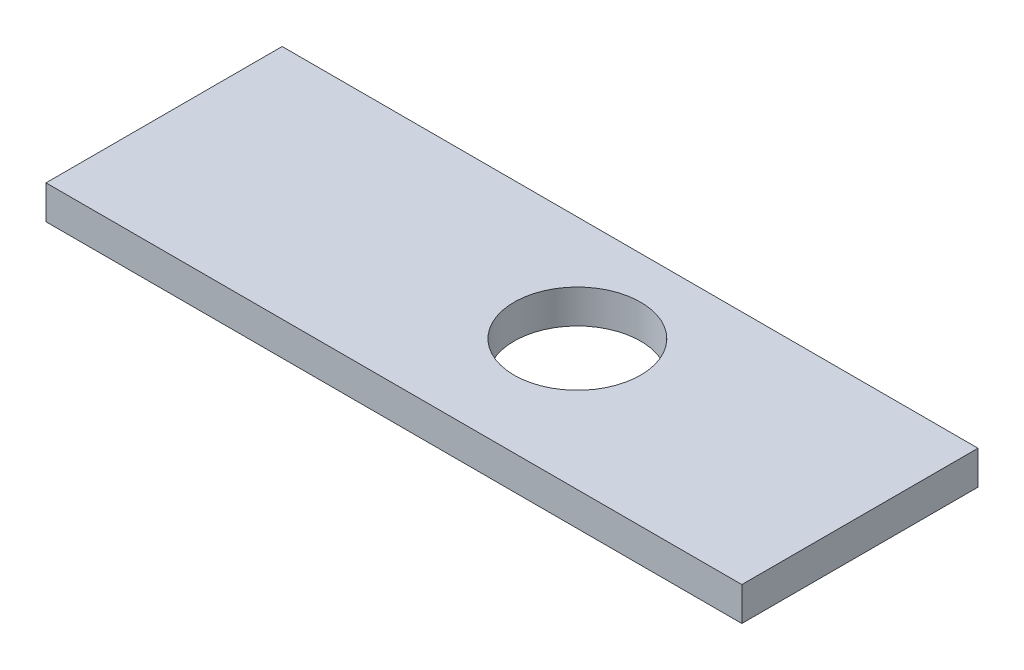
ISO-10303-21;
HEADER;
FILE_DESCRIPTION(('STEP AP214'),'2;1');
FILE_NAME('part.step','',(''),(''),'','','');
FILE_SCHEMA(('AUTOMOTIVE_DESIGN { 1 0 10303 214 1 1 1 1 }'));
ENDSEC;
DATA;
#1=APPLICATION_CONTEXT('core data for automotive mechanical design processes');
#2=APPLICATION_PROTOCOL_DEFINITION('international standard','automotive_design',2000,#1);
#3=PRODUCT_CONTEXT('',#1,'mechanical');
#4=PRODUCT('Part','Part','',(#3));
#5=PRODUCT_RELATED_PRODUCT_CATEGORY('part','',(#4));
#6=PRODUCT_DEFINITION_FORMATION('','',#4);
#7=PRODUCT_DEFINITION_CONTEXT('part definition',#1,'design');
#8=PRODUCT_DEFINITION('design','',#6,#7);
#9=PRODUCT_DEFINITION_SHAPE('','',#8);
#10=(LENGTH_UNIT() NAMED_UNIT(*) SI_UNIT(.MILLI.,.METRE.));
#11=(NAMED_UNIT(*) PLANE_ANGLE_UNIT() SI_UNIT($,.RADIAN.));
#12=(NAMED_UNIT(*) SI_UNIT($,.STERADIAN.) SOLID_ANGLE_UNIT());
#13=UNCERTAINTY_MEASURE_WITH_UNIT(LENGTH_MEASURE(1.E-05),#10,'distance_accuracy_value','');
#14=(GEOMETRIC_REPRESENTATION_CONTEXT(3) GLOBAL_UNCERTAINTY_ASSIGNED_CONTEXT((#13)) GLOBAL_UNIT_ASSIGNED_CONTEXT((#10,
#11,#12)) REPRESENTATION_CONTEXT('',''));
#15=CARTESIAN_POINT('',(0.,0.,0.));
#16=DIRECTION('',(0.,0.,1.));
#17=DIRECTION('',(1.,0.,0.));
#18=AXIS2_PLACEMENT_3D('',#15,#16,#17);
#19=CARTESIAN_POINT('',(0.,8.,0.));
#20=DIRECTION('',(0.,1.,0.));
#21=DIRECTION('',(0.,0.,1.));
#22=AXIS2_PLACEMENT_3D('',#19,#20,#21);
#23=PLANE('',#22);
#24=CARTESIAN_POINT('',(12.5,7.99999999999994,-3.));
#25=DIRECTION('',(0.,1.,0.));
#26=DIRECTION('',(0.,0.,1.));
#27=AXIS2_PLACEMENT_3D('',#24,#25,#26);
#28=CIRCLE('',#27,15.);
#29=CARTESIAN_POINT('',(12.5,7.99999999999994,12.));
#30=VERTEX_POINT('',#29);
#31=EDGE_CURVE('E19',#30,#30,#28,.F.);
#32=ORIENTED_EDGE('',*,*,#31,.T.);
#33=EDGE_LOOP('',(#32));
#34=FACE_BOUND('',#33,.T.);
#35=DIRECTION('',(-1.,0.,0.));
#36=VECTOR('',#35,1.);
#37=CARTESIAN_POINT('',(82.5,8.,-28.));
#38=LINE('',#37,#36);
#39=CARTESIAN_POINT('',(-82.5,8.,-28.));
#40=VERTEX_POINT('',#39);
#41=CARTESIAN_POINT('',(82.5,8.,-28.));
#42=VERTEX_POINT('',#41);
#43=EDGE_CURVE('E69',#40,#42,#38,.F.);
#44=ORIENTED_EDGE('',*,*,#43,.F.);
#45=DIRECTION('',(0.,0.,1.));
#46=VECTOR('',#45,1.);
#47=CARTESIAN_POINT('',(-82.5,8.,-28.));
#48=LINE('',#47,#46);
#49=CARTESIAN_POINT('',(-82.5,8.,28.));
#50=VERTEX_POINT('',#49);
#51=EDGE_CURVE('E66',#50,#40,#48,.F.);
#52=ORIENTED_EDGE('',*,*,#51,.F.);
#53=DIRECTION('',(1.,0.,0.));
#54=VECTOR('',#53,1.);
#55=CARTESIAN_POINT('',(-82.5,8.,28.));
#56=LINE('',#55,#54);
#57=CARTESIAN_POINT('',(82.5,8.,28.));
#58=VERTEX_POINT('',#57);
#59=EDGE_CURVE('E57',#58,#50,#56,.F.);
#60=ORIENTED_EDGE('',*,*,#59,.F.);
#61=DIRECTION('',(0.,0.,-1.));
#62=VECTOR('',#61,1.);
#63=CARTESIAN_POINT('',(82.5,8.,28.));
#64=LINE('',#63,#62);
#65=EDGE_CURVE('E52',#42,#58,#64,.F.);
#66=ORIENTED_EDGE('',*,*,#65,.F.);
#67=EDGE_LOOP('',(#44,#52,#60,#66));
#68=FACE_BOUND('',#67,.T.);
#69=ADVANCED_FACE('F16',(#34,#68),#23,.T.);
#70=CARTESIAN_POINT('',(-82.5,0.,-28.));
#71=DIRECTION('',(-1.,0.,0.));
#72=DIRECTION('',(0.,0.,1.));
#73=AXIS2_PLACEMENT_3D('',#70,#71,#72);
#74=PLANE('',#73);
#75=DIRECTION('',(0.,1.,0.));
#76=VECTOR('',#75,1.);
#77=CARTESIAN_POINT('',(-82.5,0.,-28.));
#78=LINE('',#77,#76);
#79=CARTESIAN_POINT('',(-82.5,0.,-28.));
#80=VERTEX_POINT('',#79);
#81=EDGE_CURVE('E81',#80,#40,#78,.T.);
#82=ORIENTED_EDGE('',*,*,#81,.F.);
#83=DIRECTION('',(0.,0.,1.));
#84=VECTOR('',#83,1.);
#85=CARTESIAN_POINT('',(-82.5,0.,0.));
#86=LINE('',#85,#84);
#87=CARTESIAN_POINT('',(-82.5,0.,28.));
#88=VERTEX_POINT('',#87);
#89=EDGE_CURVE('E76',#80,#88,#86,.T.);
#90=ORIENTED_EDGE('',*,*,#89,.T.);
#91=DIRECTION('',(0.,1.,0.));
#92=VECTOR('',#91,1.);
#93=CARTESIAN_POINT('',(-82.5,0.,28.));
#94=LINE('',#93,#92);
#95=EDGE_CURVE('E62',#50,#88,#94,.F.);
#96=ORIENTED_EDGE('',*,*,#95,.F.);
#97=ORIENTED_EDGE('',*,*,#51,.T.);
#98=EDGE_LOOP('',(#82,#90,#96,#97));
#99=FACE_BOUND('',#98,.T.);
#100=ADVANCED_FACE('F75',(#99),#74,.T.);
#101=CARTESIAN_POINT('',(-82.5,0.,28.));
#102=DIRECTION('',(0.,0.,1.));
#103=DIRECTION('',(1.,0.,0.));
#104=AXIS2_PLACEMENT_3D('',#101,#102,#103);
#105=PLANE('',#104);
#106=ORIENTED_EDGE('',*,*,#95,.T.);
#107=DIRECTION('',(1.,0.,0.));
#108=VECTOR('',#107,1.);
#109=CARTESIAN_POINT('',(0.,0.,28.));
#110=LINE('',#109,#108);
#111=CARTESIAN_POINT('',(82.5,0.,28.));
#112=VERTEX_POINT('',#111);
#113=EDGE_CURVE('E86',#88,#112,#110,.T.);
#114=ORIENTED_EDGE('',*,*,#113,.T.);
#115=DIRECTION('',(0.,1.,0.));
#116=VECTOR('',#115,1.);
#117=CARTESIAN_POINT('',(82.5,0.,28.));
#118=LINE('',#117,#116);
#119=EDGE_CURVE('E64',#58,#112,#118,.F.);
#120=ORIENTED_EDGE('',*,*,#119,.F.);
#121=ORIENTED_EDGE('',*,*,#59,.T.);
#122=EDGE_LOOP('',(#106,#114,#120,#121));
#123=FACE_BOUND('',#122,.T.);
#124=ADVANCED_FACE('F59',(#123),#105,.T.);
#125=CARTESIAN_POINT('',(82.5,0.,28.));
#126=DIRECTION('',(1.,0.,0.));
#127=DIRECTION('',(0.,0.,-1.));
#128=AXIS2_PLACEMENT_3D('',#125,#126,#127);
#129=PLANE('',#128);
#130=ORIENTED_EDGE('',*,*,#119,.T.);
#131=DIRECTION('',(0.,0.,1.));
#132=VECTOR('',#131,1.);
#133=CARTESIAN_POINT('',(82.5,0.,0.));
#134=LINE('',#133,#132);
#135=CARTESIAN_POINT('',(82.5,0.,-28.));
#136=VERTEX_POINT('',#135);
#137=EDGE_CURVE('E88',#112,#136,#134,.F.);
#138=ORIENTED_EDGE('',*,*,#137,.T.);
#139=DIRECTION('',(0.,1.,0.));
#140=VECTOR('',#139,1.);
#141=CARTESIAN_POINT('',(82.5,0.,-28.));
#142=LINE('',#141,#140);
#143=EDGE_CURVE('E33',#42,#136,#142,.F.);
#144=ORIENTED_EDGE('',*,*,#143,.F.);
#145=ORIENTED_EDGE('',*,*,#65,.T.);
#146=EDGE_LOOP('',(#130,#138,#144,#145));
#147=FACE_BOUND('',#146,.T.);
#148=ADVANCED_FACE('F95',(#147),#129,.T.);
#149=CARTESIAN_POINT('',(82.5,0.,-28.));
#150=DIRECTION('',(0.,0.,-1.));
#151=DIRECTION('',(-1.,0.,0.));
#152=AXIS2_PLACEMENT_3D('',#149,#150,#151);
#153=PLANE('',#152);
#154=ORIENTED_EDGE('',*,*,#143,.T.);
#155=DIRECTION('',(1.,0.,0.));
#156=VECTOR('',#155,1.);
#157=CARTESIAN_POINT('',(0.,0.,-28.));
#158=LINE('',#157,#156);
#159=EDGE_CURVE('E25',#136,#80,#158,.F.);
#160=ORIENTED_EDGE('',*,*,#159,.T.);
#161=ORIENTED_EDGE('',*,*,#81,.T.);
#162=ORIENTED_EDGE('',*,*,#43,.T.);
#163=EDGE_LOOP('',(#154,#160,#161,#162));
#164=FACE_BOUND('',#163,.T.);
#165=ADVANCED_FACE('F91',(#164),#153,.T.);
#166=CARTESIAN_POINT('',(12.5,0.,-3.));
#167=DIRECTION('',(0.,1.,0.));
#168=DIRECTION('',(0.,0.,1.));
#169=AXIS2_PLACEMENT_3D('',#166,#167,#168);
#170=CYLINDRICAL_SURFACE('',#169,15.);
#171=ORIENTED_EDGE('',*,*,#31,.F.);
#172=EDGE_LOOP('',(#171));
#173=FACE_BOUND('',#172,.T.);
#174=CARTESIAN_POINT('',(12.5,0.,-3.));
#175=DIRECTION('',(0.,1.,0.));
#176=DIRECTION('',(0.,0.,1.));
#177=AXIS2_PLACEMENT_3D('',#174,#175,#176);
#178=CIRCLE('',#177,15.);
#179=CARTESIAN_POINT('',(12.5,0.,12.));
#180=VERTEX_POINT('',#179);
#181=EDGE_CURVE('E11',#180,#180,#178,.F.);
#182=ORIENTED_EDGE('',*,*,#181,.T.);
#183=EDGE_LOOP('',(#182));
#184=FACE_BOUND('',#183,.T.);
#185=ADVANCED_FACE('F103',(#173,#184),#170,.F.);
#186=CARTESIAN_POINT('',(0.,0.,0.));
#187=DIRECTION('',(0.,1.,0.));
#188=DIRECTION('',(0.,0.,1.));
#189=AXIS2_PLACEMENT_3D('',#186,#187,#188);
#190=PLANE('',#189);
#191=ORIENTED_EDGE('',*,*,#181,.F.);
#192=EDGE_LOOP('',(#191));
#193=FACE_BOUND('',#192,.T.);
#194=ORIENTED_EDGE('',*,*,#137,.F.);
#195=ORIENTED_EDGE('',*,*,#113,.F.);
#196=ORIENTED_EDGE('',*,*,#89,.F.);
#197=ORIENTED_EDGE('',*,*,#159,.F.);
#198=EDGE_LOOP('',(#194,#195,#196,#197));
#199=FACE_BOUND('',#198,.T.);
#200=ADVANCED_FACE('F94',(#193,#199),#190,.F.);
#201=CLOSED_SHELL('',(#69,#100,#124,#148,#165,#185,#200));
#202=MANIFOLD_SOLID_BREP('B1',#201);
#203=ADVANCED_BREP_SHAPE_REPRESENTATION('',(#18,#202),#14);
#204=SHAPE_DEFINITION_REPRESENTATION(#9,#203);
ENDSEC;
END-ISO-10303-21;
